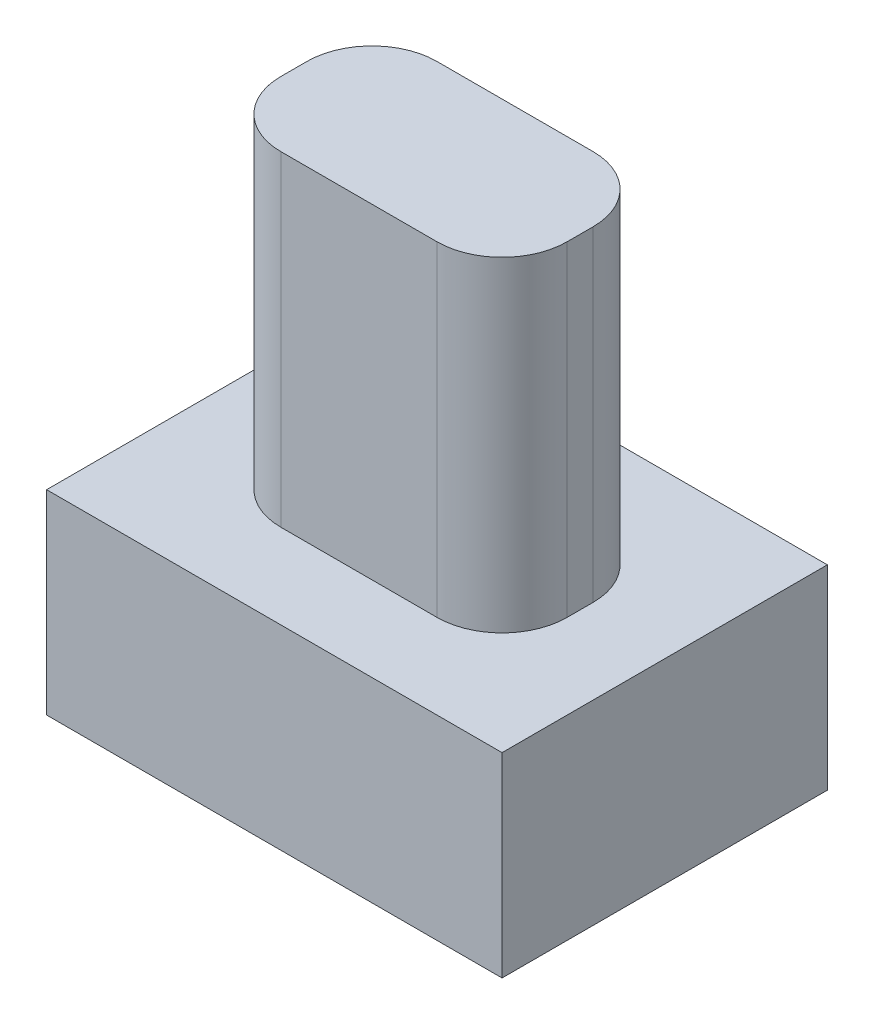
ISO-10303-21;
HEADER;
FILE_DESCRIPTION(('STEP AP214'),'2;1');
FILE_NAME('part.step','',(''),(''),'','','');
FILE_SCHEMA(('AUTOMOTIVE_DESIGN { 1 0 10303 214 1 1 1 1 }'));
ENDSEC;
DATA;
#1=APPLICATION_CONTEXT('core data for automotive mechanical design processes');
#2=APPLICATION_PROTOCOL_DEFINITION('international standard','automotive_design',2000,#1);
#3=PRODUCT_CONTEXT('',#1,'mechanical');
#4=PRODUCT('Part','Part','',(#3));
#5=PRODUCT_RELATED_PRODUCT_CATEGORY('part','',(#4));
#6=PRODUCT_DEFINITION_FORMATION('','',#4);
#7=PRODUCT_DEFINITION_CONTEXT('part definition',#1,'design');
#8=PRODUCT_DEFINITION('design','',#6,#7);
#9=PRODUCT_DEFINITION_SHAPE('','',#8);
#10=(LENGTH_UNIT() NAMED_UNIT(*) SI_UNIT(.MILLI.,.METRE.));
#11=(NAMED_UNIT(*) PLANE_ANGLE_UNIT() SI_UNIT($,.RADIAN.));
#12=(NAMED_UNIT(*) SI_UNIT($,.STERADIAN.) SOLID_ANGLE_UNIT());
#13=UNCERTAINTY_MEASURE_WITH_UNIT(LENGTH_MEASURE(1.E-05),#10,'distance_accuracy_value','');
#14=(GEOMETRIC_REPRESENTATION_CONTEXT(3) GLOBAL_UNCERTAINTY_ASSIGNED_CONTEXT((#13)) GLOBAL_UNIT_ASSIGNED_CONTEXT((#10,
#11,#12)) REPRESENTATION_CONTEXT('',''));
#15=CARTESIAN_POINT('',(0.,0.,0.));
#16=DIRECTION('',(0.,0.,1.));
#17=DIRECTION('',(1.,0.,0.));
#18=AXIS2_PLACEMENT_3D('',#15,#16,#17);
#19=CARTESIAN_POINT('',(3.5,3.,-2.5));
#20=DIRECTION('',(-1.,0.,0.));
#21=DIRECTION('',(0.,0.,1.));
#22=AXIS2_PLACEMENT_3D('',#19,#20,#21);
#23=PLANE('',#22);
#24=DIRECTION('',(0.,0.,-1.));
#25=VECTOR('',#24,1.);
#26=CARTESIAN_POINT('',(3.5,0.,-2.5));
#27=LINE('',#26,#25);
#28=CARTESIAN_POINT('',(3.5,0.,2.5));
#29=VERTEX_POINT('',#28);
#30=CARTESIAN_POINT('',(3.5,0.,-2.5));
#31=VERTEX_POINT('',#30);
#32=EDGE_CURVE('E157',#29,#31,#27,.T.);
#33=ORIENTED_EDGE('',*,*,#32,.T.);
#34=DIRECTION('',(0.,-1.,0.));
#35=VECTOR('',#34,1.);
#36=CARTESIAN_POINT('',(3.5,3.,-2.5));
#37=LINE('',#36,#35);
#38=CARTESIAN_POINT('',(3.5,3.,-2.5));
#39=VERTEX_POINT('',#38);
#40=EDGE_CURVE('E136',#39,#31,#37,.T.);
#41=ORIENTED_EDGE('',*,*,#40,.F.);
#42=DIRECTION('',(0.,0.,-1.));
#43=VECTOR('',#42,1.);
#44=CARTESIAN_POINT('',(3.5,3.,-2.5));
#45=LINE('',#44,#43);
#46=CARTESIAN_POINT('',(3.5,3.,2.5));
#47=VERTEX_POINT('',#46);
#48=EDGE_CURVE('E144',#47,#39,#45,.T.);
#49=ORIENTED_EDGE('',*,*,#48,.F.);
#50=DIRECTION('',(0.,-1.,0.));
#51=VECTOR('',#50,1.);
#52=CARTESIAN_POINT('',(3.5,3.,2.5));
#53=LINE('',#52,#51);
#54=EDGE_CURVE('E263',#47,#29,#53,.T.);
#55=ORIENTED_EDGE('',*,*,#54,.T.);
#56=EDGE_LOOP('',(#33,#41,#49,#55));
#57=FACE_BOUND('',#56,.T.);
#58=ADVANCED_FACE('F43',(#57),#23,.F.);
#59=CARTESIAN_POINT('',(-3.5,3.,-2.5));
#60=DIRECTION('',(0.,0.,1.));
#61=DIRECTION('',(1.,0.,0.));
#62=AXIS2_PLACEMENT_3D('',#59,#60,#61);
#63=PLANE('',#62);
#64=DIRECTION('',(-1.,0.,0.));
#65=VECTOR('',#64,1.);
#66=CARTESIAN_POINT('',(-3.5,0.,-2.5));
#67=LINE('',#66,#65);
#68=CARTESIAN_POINT('',(-3.5,0.,-2.5));
#69=VERTEX_POINT('',#68);
#70=EDGE_CURVE('E266',#31,#69,#67,.T.);
#71=ORIENTED_EDGE('',*,*,#70,.T.);
#72=DIRECTION('',(0.,-1.,0.));
#73=VECTOR('',#72,1.);
#74=CARTESIAN_POINT('',(-3.5,3.,-2.5));
#75=LINE('',#74,#73);
#76=CARTESIAN_POINT('',(-3.5,3.,-2.5));
#77=VERTEX_POINT('',#76);
#78=EDGE_CURVE('E139',#77,#69,#75,.T.);
#79=ORIENTED_EDGE('',*,*,#78,.F.);
#80=DIRECTION('',(-1.,0.,0.));
#81=VECTOR('',#80,1.);
#82=CARTESIAN_POINT('',(-3.5,3.,-2.5));
#83=LINE('',#82,#81);
#84=EDGE_CURVE('E132',#39,#77,#83,.T.);
#85=ORIENTED_EDGE('',*,*,#84,.F.);
#86=ORIENTED_EDGE('',*,*,#40,.T.);
#87=EDGE_LOOP('',(#71,#79,#85,#86));
#88=FACE_BOUND('',#87,.T.);
#89=ADVANCED_FACE('F134',(#88),#63,.F.);
#90=CARTESIAN_POINT('',(-3.5,3.,-2.5));
#91=DIRECTION('',(1.,0.,0.));
#92=DIRECTION('',(0.,0.,-1.));
#93=AXIS2_PLACEMENT_3D('',#90,#91,#92);
#94=PLANE('',#93);
#95=DIRECTION('',(0.,0.,1.));
#96=VECTOR('',#95,1.);
#97=CARTESIAN_POINT('',(-3.5,0.,-2.5));
#98=LINE('',#97,#96);
#99=CARTESIAN_POINT('',(-3.5,0.,2.5));
#100=VERTEX_POINT('',#99);
#101=EDGE_CURVE('E269',#69,#100,#98,.T.);
#102=ORIENTED_EDGE('',*,*,#101,.T.);
#103=DIRECTION('',(0.,-1.,0.));
#104=VECTOR('',#103,1.);
#105=CARTESIAN_POINT('',(-3.5,3.,2.5));
#106=LINE('',#105,#104);
#107=CARTESIAN_POINT('',(-3.5,3.,2.5));
#108=VERTEX_POINT('',#107);
#109=EDGE_CURVE('E165',#108,#100,#106,.T.);
#110=ORIENTED_EDGE('',*,*,#109,.F.);
#111=DIRECTION('',(0.,0.,1.));
#112=VECTOR('',#111,1.);
#113=CARTESIAN_POINT('',(-3.5,3.,-2.5));
#114=LINE('',#113,#112);
#115=EDGE_CURVE('E143',#77,#108,#114,.T.);
#116=ORIENTED_EDGE('',*,*,#115,.F.);
#117=ORIENTED_EDGE('',*,*,#78,.T.);
#118=EDGE_LOOP('',(#102,#110,#116,#117));
#119=FACE_BOUND('',#118,.T.);
#120=ADVANCED_FACE('F285',(#119),#94,.F.);
#121=CARTESIAN_POINT('',(-3.5,3.,2.5));
#122=DIRECTION('',(0.,0.,-1.));
#123=DIRECTION('',(-1.,0.,0.));
#124=AXIS2_PLACEMENT_3D('',#121,#122,#123);
#125=PLANE('',#124);
#126=DIRECTION('',(1.,0.,0.));
#127=VECTOR('',#126,1.);
#128=CARTESIAN_POINT('',(-3.5,0.,2.5));
#129=LINE('',#128,#127);
#130=EDGE_CURVE('E154',#100,#29,#129,.T.);
#131=ORIENTED_EDGE('',*,*,#130,.T.);
#132=ORIENTED_EDGE('',*,*,#54,.F.);
#133=DIRECTION('',(1.,0.,0.));
#134=VECTOR('',#133,1.);
#135=CARTESIAN_POINT('',(-3.5,3.,2.5));
#136=LINE('',#135,#134);
#137=EDGE_CURVE('E149',#108,#47,#136,.T.);
#138=ORIENTED_EDGE('',*,*,#137,.F.);
#139=ORIENTED_EDGE('',*,*,#109,.T.);
#140=EDGE_LOOP('',(#131,#132,#138,#139));
#141=FACE_BOUND('',#140,.T.);
#142=ADVANCED_FACE('F280',(#141),#125,.F.);
#143=CARTESIAN_POINT('',(0.,3.,0.));
#144=DIRECTION('',(0.,1.,0.));
#145=DIRECTION('',(0.,0.,1.));
#146=AXIS2_PLACEMENT_3D('',#143,#144,#145);
#147=PLANE('',#146);
#148=DIRECTION('',(0.,0.,-1.));
#149=VECTOR('',#148,1.);
#150=CARTESIAN_POINT('',(2.2,3.,-1.2));
#151=LINE('',#150,#149);
#152=CARTESIAN_POINT('',(2.2,3.,0.2));
#153=VERTEX_POINT('',#152);
#154=CARTESIAN_POINT('',(2.2,3.,-0.2));
#155=VERTEX_POINT('',#154);
#156=EDGE_CURVE('E212',#153,#155,#151,.T.);
#157=ORIENTED_EDGE('',*,*,#156,.F.);
#158=CARTESIAN_POINT('',(1.2,3.,0.2));
#159=DIRECTION('',(0.,1.,0.));
#160=DIRECTION('',(0.,0.,1.));
#161=AXIS2_PLACEMENT_3D('',#158,#159,#160);
#162=CIRCLE('',#161,1.);
#163=CARTESIAN_POINT('',(1.2,3.,1.2));
#164=VERTEX_POINT('',#163);
#165=EDGE_CURVE('E52',#153,#164,#162,.F.);
#166=ORIENTED_EDGE('',*,*,#165,.T.);
#167=DIRECTION('',(1.,0.,0.));
#168=VECTOR('',#167,1.);
#169=CARTESIAN_POINT('',(-2.2,3.,1.2));
#170=LINE('',#169,#168);
#171=CARTESIAN_POINT('',(-1.2,3.,1.2));
#172=VERTEX_POINT('',#171);
#173=EDGE_CURVE('E245',#172,#164,#170,.T.);
#174=ORIENTED_EDGE('',*,*,#173,.F.);
#175=CARTESIAN_POINT('',(-1.2,3.,0.2));
#176=DIRECTION('',(0.,1.,0.));
#177=DIRECTION('',(0.,0.,1.));
#178=AXIS2_PLACEMENT_3D('',#175,#176,#177);
#179=CIRCLE('',#178,1.);
#180=CARTESIAN_POINT('',(-2.2,3.,0.2));
#181=VERTEX_POINT('',#180);
#182=EDGE_CURVE('E11',#172,#181,#179,.F.);
#183=ORIENTED_EDGE('',*,*,#182,.T.);
#184=DIRECTION('',(0.,0.,1.));
#185=VECTOR('',#184,1.);
#186=CARTESIAN_POINT('',(-2.2,3.,-1.2));
#187=LINE('',#186,#185);
#188=CARTESIAN_POINT('',(-2.2,3.,-0.2));
#189=VERTEX_POINT('',#188);
#190=EDGE_CURVE('E253',#189,#181,#187,.T.);
#191=ORIENTED_EDGE('',*,*,#190,.F.);
#192=CARTESIAN_POINT('',(-1.2,3.,-0.2));
#193=DIRECTION('',(0.,1.,0.));
#194=DIRECTION('',(0.,0.,1.));
#195=AXIS2_PLACEMENT_3D('',#192,#193,#194);
#196=CIRCLE('',#195,1.);
#197=CARTESIAN_POINT('',(-1.2,3.,-1.2));
#198=VERTEX_POINT('',#197);
#199=EDGE_CURVE('E204',#189,#198,#196,.F.);
#200=ORIENTED_EDGE('',*,*,#199,.T.);
#201=DIRECTION('',(-1.,0.,0.));
#202=VECTOR('',#201,1.);
#203=CARTESIAN_POINT('',(-2.2,3.,-1.2));
#204=LINE('',#203,#202);
#205=CARTESIAN_POINT('',(1.2,3.,-1.2));
#206=VERTEX_POINT('',#205);
#207=EDGE_CURVE('E214',#206,#198,#204,.T.);
#208=ORIENTED_EDGE('',*,*,#207,.F.);
#209=CARTESIAN_POINT('',(1.2,3.,-0.2));
#210=DIRECTION('',(0.,1.,0.));
#211=DIRECTION('',(0.,0.,1.));
#212=AXIS2_PLACEMENT_3D('',#209,#210,#211);
#213=CIRCLE('',#212,1.);
#214=EDGE_CURVE('E207',#206,#155,#213,.F.);
#215=ORIENTED_EDGE('',*,*,#214,.T.);
#216=EDGE_LOOP('',(#157,#166,#174,#183,#191,#200,#208,#215));
#217=FACE_BOUND('',#216,.T.);
#218=ORIENTED_EDGE('',*,*,#48,.T.);
#219=ORIENTED_EDGE('',*,*,#84,.T.);
#220=ORIENTED_EDGE('',*,*,#115,.T.);
#221=ORIENTED_EDGE('',*,*,#137,.T.);
#222=EDGE_LOOP('',(#218,#219,#220,#221));
#223=FACE_BOUND('',#222,.T.);
#224=ADVANCED_FACE('F147',(#217,#223),#147,.T.);
#225=CARTESIAN_POINT('',(0.,0.,0.));
#226=DIRECTION('',(0.,1.,0.));
#227=DIRECTION('',(0.,0.,1.));
#228=AXIS2_PLACEMENT_3D('',#225,#226,#227);
#229=PLANE('',#228);
#230=ORIENTED_EDGE('',*,*,#32,.F.);
#231=ORIENTED_EDGE('',*,*,#130,.F.);
#232=ORIENTED_EDGE('',*,*,#101,.F.);
#233=ORIENTED_EDGE('',*,*,#70,.F.);
#234=EDGE_LOOP('',(#230,#231,#232,#233));
#235=FACE_BOUND('',#234,.T.);
#236=ADVANCED_FACE('F284',(#235),#229,.F.);
#237=CARTESIAN_POINT('',(2.2,8.,-1.2));
#238=DIRECTION('',(-1.,0.,0.));
#239=DIRECTION('',(0.,0.,1.));
#240=AXIS2_PLACEMENT_3D('',#237,#238,#239);
#241=PLANE('',#240);
#242=ORIENTED_EDGE('',*,*,#156,.T.);
#243=DIRECTION('',(0.,-1.,0.));
#244=VECTOR('',#243,1.);
#245=CARTESIAN_POINT('',(2.2,8.,-0.2));
#246=LINE('',#245,#244);
#247=CARTESIAN_POINT('',(2.2,8.,-0.2));
#248=VERTEX_POINT('',#247);
#249=EDGE_CURVE('E195',#155,#248,#246,.F.);
#250=ORIENTED_EDGE('',*,*,#249,.T.);
#251=DIRECTION('',(0.,0.,-1.));
#252=VECTOR('',#251,1.);
#253=CARTESIAN_POINT('',(2.2,8.,-1.2));
#254=LINE('',#253,#252);
#255=CARTESIAN_POINT('',(2.2,8.,0.2));
#256=VERTEX_POINT('',#255);
#257=EDGE_CURVE('E233',#256,#248,#254,.T.);
#258=ORIENTED_EDGE('',*,*,#257,.F.);
#259=DIRECTION('',(0.,-1.,0.));
#260=VECTOR('',#259,1.);
#261=CARTESIAN_POINT('',(2.2,8.,0.2));
#262=LINE('',#261,#260);
#263=EDGE_CURVE('E191',#256,#153,#262,.T.);
#264=ORIENTED_EDGE('',*,*,#263,.T.);
#265=EDGE_LOOP('',(#242,#250,#258,#264));
#266=FACE_BOUND('',#265,.T.);
#267=ADVANCED_FACE('F219',(#266),#241,.F.);
#268=CARTESIAN_POINT('',(-2.2,8.,-1.2));
#269=DIRECTION('',(0.,0.,1.));
#270=DIRECTION('',(1.,0.,0.));
#271=AXIS2_PLACEMENT_3D('',#268,#269,#270);
#272=PLANE('',#271);
#273=ORIENTED_EDGE('',*,*,#207,.T.);
#274=DIRECTION('',(0.,-1.,0.));
#275=VECTOR('',#274,1.);
#276=CARTESIAN_POINT('',(-1.2,8.,-1.2));
#277=LINE('',#276,#275);
#278=CARTESIAN_POINT('',(-1.2,8.,-1.2));
#279=VERTEX_POINT('',#278);
#280=EDGE_CURVE('E176',#198,#279,#277,.F.);
#281=ORIENTED_EDGE('',*,*,#280,.T.);
#282=DIRECTION('',(-1.,0.,0.));
#283=VECTOR('',#282,1.);
#284=CARTESIAN_POINT('',(-2.2,8.,-1.2));
#285=LINE('',#284,#283);
#286=CARTESIAN_POINT('',(1.2,8.,-1.2));
#287=VERTEX_POINT('',#286);
#288=EDGE_CURVE('E231',#287,#279,#285,.T.);
#289=ORIENTED_EDGE('',*,*,#288,.F.);
#290=DIRECTION('',(0.,-1.,0.));
#291=VECTOR('',#290,1.);
#292=CARTESIAN_POINT('',(1.2,8.,-1.2));
#293=LINE('',#292,#291);
#294=EDGE_CURVE('E172',#287,#206,#293,.T.);
#295=ORIENTED_EDGE('',*,*,#294,.T.);
#296=EDGE_LOOP('',(#273,#281,#289,#295));
#297=FACE_BOUND('',#296,.T.);
#298=ADVANCED_FACE('F235',(#297),#272,.F.);
#299=CARTESIAN_POINT('',(-2.2,8.,-1.2));
#300=DIRECTION('',(1.,0.,0.));
#301=DIRECTION('',(0.,0.,-1.));
#302=AXIS2_PLACEMENT_3D('',#299,#300,#301);
#303=PLANE('',#302);
#304=DIRECTION('',(0.,0.,1.));
#305=VECTOR('',#304,1.);
#306=CARTESIAN_POINT('',(-2.2,8.,-1.2));
#307=LINE('',#306,#305);
#308=CARTESIAN_POINT('',(-2.2,8.,-0.2));
#309=VERTEX_POINT('',#308);
#310=CARTESIAN_POINT('',(-2.2,8.,0.2));
#311=VERTEX_POINT('',#310);
#312=EDGE_CURVE('E238',#309,#311,#307,.T.);
#313=ORIENTED_EDGE('',*,*,#312,.F.);
#314=DIRECTION('',(0.,-1.,0.));
#315=VECTOR('',#314,1.);
#316=CARTESIAN_POINT('',(-2.2,8.,-0.2));
#317=LINE('',#316,#315);
#318=EDGE_CURVE('E163',#309,#189,#317,.T.);
#319=ORIENTED_EDGE('',*,*,#318,.T.);
#320=ORIENTED_EDGE('',*,*,#190,.T.);
#321=DIRECTION('',(0.,-1.,0.));
#322=VECTOR('',#321,1.);
#323=CARTESIAN_POINT('',(-2.2,8.,0.2));
#324=LINE('',#323,#322);
#325=EDGE_CURVE('E159',#181,#311,#324,.F.);
#326=ORIENTED_EDGE('',*,*,#325,.T.);
#327=EDGE_LOOP('',(#313,#319,#320,#326));
#328=FACE_BOUND('',#327,.T.);
#329=ADVANCED_FACE('F318',(#328),#303,.F.);
#330=CARTESIAN_POINT('',(-2.2,8.,1.2));
#331=DIRECTION('',(0.,0.,-1.));
#332=DIRECTION('',(-1.,0.,0.));
#333=AXIS2_PLACEMENT_3D('',#330,#331,#332);
#334=PLANE('',#333);
#335=ORIENTED_EDGE('',*,*,#173,.T.);
#336=DIRECTION('',(0.,-1.,0.));
#337=VECTOR('',#336,1.);
#338=CARTESIAN_POINT('',(1.2,8.,1.2));
#339=LINE('',#338,#337);
#340=CARTESIAN_POINT('',(1.2,8.,1.2));
#341=VERTEX_POINT('',#340);
#342=EDGE_CURVE('E201',#164,#341,#339,.F.);
#343=ORIENTED_EDGE('',*,*,#342,.T.);
#344=DIRECTION('',(1.,0.,0.));
#345=VECTOR('',#344,1.);
#346=CARTESIAN_POINT('',(-2.2,8.,1.2));
#347=LINE('',#346,#345);
#348=CARTESIAN_POINT('',(-1.2,8.,1.2));
#349=VERTEX_POINT('',#348);
#350=EDGE_CURVE('E243',#349,#341,#347,.T.);
#351=ORIENTED_EDGE('',*,*,#350,.F.);
#352=DIRECTION('',(0.,-1.,0.));
#353=VECTOR('',#352,1.);
#354=CARTESIAN_POINT('',(-1.2,8.,1.2));
#355=LINE('',#354,#353);
#356=EDGE_CURVE('E198',#349,#172,#355,.T.);
#357=ORIENTED_EDGE('',*,*,#356,.T.);
#358=EDGE_LOOP('',(#335,#343,#351,#357));
#359=FACE_BOUND('',#358,.T.);
#360=ADVANCED_FACE('F315',(#359),#334,.F.);
#361=CARTESIAN_POINT('',(0.,8.,0.));
#362=DIRECTION('',(0.,1.,0.));
#363=DIRECTION('',(0.,0.,1.));
#364=AXIS2_PLACEMENT_3D('',#361,#362,#363);
#365=PLANE('',#364);
#366=ORIENTED_EDGE('',*,*,#288,.T.);
#367=CARTESIAN_POINT('',(-1.2,8.,-0.2));
#368=DIRECTION('',(0.,1.,0.));
#369=DIRECTION('',(0.,0.,1.));
#370=AXIS2_PLACEMENT_3D('',#367,#368,#369);
#371=CIRCLE('',#370,1.);
#372=EDGE_CURVE('E188',#279,#309,#371,.T.);
#373=ORIENTED_EDGE('',*,*,#372,.T.);
#374=ORIENTED_EDGE('',*,*,#312,.T.);
#375=CARTESIAN_POINT('',(-1.2,8.,0.2));
#376=DIRECTION('',(0.,1.,0.));
#377=DIRECTION('',(0.,0.,1.));
#378=AXIS2_PLACEMENT_3D('',#375,#376,#377);
#379=CIRCLE('',#378,1.);
#380=EDGE_CURVE('E179',#311,#349,#379,.T.);
#381=ORIENTED_EDGE('',*,*,#380,.T.);
#382=ORIENTED_EDGE('',*,*,#350,.T.);
#383=CARTESIAN_POINT('',(1.2,8.,0.2));
#384=DIRECTION('',(0.,1.,0.));
#385=DIRECTION('',(0.,0.,1.));
#386=AXIS2_PLACEMENT_3D('',#383,#384,#385);
#387=CIRCLE('',#386,1.);
#388=EDGE_CURVE('E182',#341,#256,#387,.T.);
#389=ORIENTED_EDGE('',*,*,#388,.T.);
#390=ORIENTED_EDGE('',*,*,#257,.T.);
#391=CARTESIAN_POINT('',(1.2,8.,-0.2));
#392=DIRECTION('',(0.,1.,0.));
#393=DIRECTION('',(0.,0.,1.));
#394=AXIS2_PLACEMENT_3D('',#391,#392,#393);
#395=CIRCLE('',#394,1.);
#396=EDGE_CURVE('E185',#248,#287,#395,.T.);
#397=ORIENTED_EDGE('',*,*,#396,.T.);
#398=EDGE_LOOP('',(#366,#373,#374,#381,#382,#389,#390,#397));
#399=FACE_BOUND('',#398,.T.);
#400=ADVANCED_FACE('F230',(#399),#365,.T.);
#401=CARTESIAN_POINT('',(-1.2,8.,-0.2));
#402=DIRECTION('',(0.,-1.,0.));
#403=DIRECTION('',(0.,0.,-1.));
#404=AXIS2_PLACEMENT_3D('',#401,#402,#403);
#405=CYLINDRICAL_SURFACE('',#404,1.);
#406=ORIENTED_EDGE('',*,*,#372,.F.);
#407=ORIENTED_EDGE('',*,*,#280,.F.);
#408=ORIENTED_EDGE('',*,*,#199,.F.);
#409=ORIENTED_EDGE('',*,*,#318,.F.);
#410=EDGE_LOOP('',(#406,#407,#408,#409));
#411=FACE_BOUND('',#410,.T.);
#412=ADVANCED_FACE('F299',(#411),#405,.T.);
#413=CARTESIAN_POINT('',(1.2,8.,-0.2));
#414=DIRECTION('',(0.,-1.,0.));
#415=DIRECTION('',(0.,0.,-1.));
#416=AXIS2_PLACEMENT_3D('',#413,#414,#415);
#417=CYLINDRICAL_SURFACE('',#416,1.);
#418=ORIENTED_EDGE('',*,*,#396,.F.);
#419=ORIENTED_EDGE('',*,*,#249,.F.);
#420=ORIENTED_EDGE('',*,*,#214,.F.);
#421=ORIENTED_EDGE('',*,*,#294,.F.);
#422=EDGE_LOOP('',(#418,#419,#420,#421));
#423=FACE_BOUND('',#422,.T.);
#424=ADVANCED_FACE('F226',(#423),#417,.T.);
#425=CARTESIAN_POINT('',(1.2,8.,0.2));
#426=DIRECTION('',(0.,-1.,0.));
#427=DIRECTION('',(0.,0.,-1.));
#428=AXIS2_PLACEMENT_3D('',#425,#426,#427);
#429=CYLINDRICAL_SURFACE('',#428,1.);
#430=ORIENTED_EDGE('',*,*,#388,.F.);
#431=ORIENTED_EDGE('',*,*,#342,.F.);
#432=ORIENTED_EDGE('',*,*,#165,.F.);
#433=ORIENTED_EDGE('',*,*,#263,.F.);
#434=EDGE_LOOP('',(#430,#431,#432,#433));
#435=FACE_BOUND('',#434,.T.);
#436=ADVANCED_FACE('F304',(#435),#429,.T.);
#437=CARTESIAN_POINT('',(-1.2,8.,0.2));
#438=DIRECTION('',(0.,-1.,0.));
#439=DIRECTION('',(0.,0.,-1.));
#440=AXIS2_PLACEMENT_3D('',#437,#438,#439);
#441=CYLINDRICAL_SURFACE('',#440,1.);
#442=ORIENTED_EDGE('',*,*,#380,.F.);
#443=ORIENTED_EDGE('',*,*,#325,.F.);
#444=ORIENTED_EDGE('',*,*,#182,.F.);
#445=ORIENTED_EDGE('',*,*,#356,.F.);
#446=EDGE_LOOP('',(#442,#443,#444,#445));
#447=FACE_BOUND('',#446,.T.);
#448=ADVANCED_FACE('F45',(#447),#441,.T.);
#449=CLOSED_SHELL('',(#58,#89,#120,#142,#224,#236,#267,#298,#329,#360,#400,#412,#424,#436,#448));
#450=MANIFOLD_SOLID_BREP('B2',#449);
#451=ADVANCED_BREP_SHAPE_REPRESENTATION('',(#18,#450),#14);
#452=SHAPE_DEFINITION_REPRESENTATION(#9,#451);
ENDSEC;
END-ISO-10303-21;
